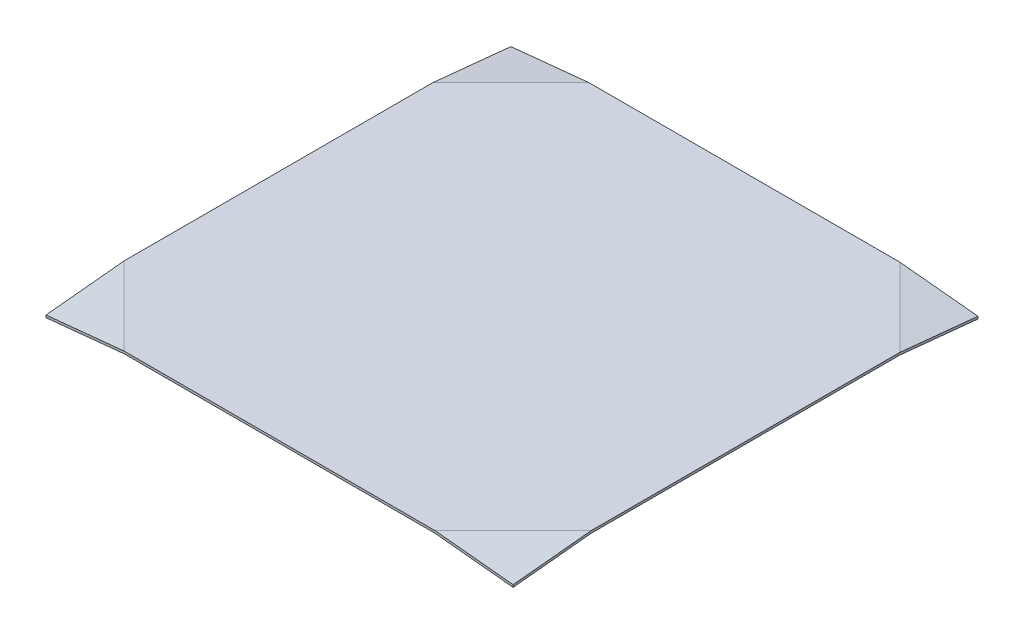
ISO-10303-21;
HEADER;
FILE_DESCRIPTION(('STEP AP214'),'2;1');
FILE_NAME('part.step','',(''),(''),'','','');
FILE_SCHEMA(('AUTOMOTIVE_DESIGN { 1 0 10303 214 1 1 1 1 }'));
ENDSEC;
DATA;
#1=APPLICATION_CONTEXT('core data for automotive mechanical design processes');
#2=APPLICATION_PROTOCOL_DEFINITION('international standard','automotive_design',2000,#1);
#3=PRODUCT_CONTEXT('',#1,'mechanical');
#4=PRODUCT('Part','Part','',(#3));
#5=PRODUCT_RELATED_PRODUCT_CATEGORY('part','',(#4));
#6=PRODUCT_DEFINITION_FORMATION('','',#4);
#7=PRODUCT_DEFINITION_CONTEXT('part definition',#1,'design');
#8=PRODUCT_DEFINITION('design','',#6,#7);
#9=PRODUCT_DEFINITION_SHAPE('','',#8);
#10=(LENGTH_UNIT() NAMED_UNIT(*) SI_UNIT(.MILLI.,.METRE.));
#11=(NAMED_UNIT(*) PLANE_ANGLE_UNIT() SI_UNIT($,.RADIAN.));
#12=(NAMED_UNIT(*) SI_UNIT($,.STERADIAN.) SOLID_ANGLE_UNIT());
#13=UNCERTAINTY_MEASURE_WITH_UNIT(LENGTH_MEASURE(1.E-05),#10,'distance_accuracy_value','');
#14=(GEOMETRIC_REPRESENTATION_CONTEXT(3) GLOBAL_UNCERTAINTY_ASSIGNED_CONTEXT((#13)) GLOBAL_UNIT_ASSIGNED_CONTEXT((#10,
#11,#12)) REPRESENTATION_CONTEXT('',''));
#15=CARTESIAN_POINT('',(0.,0.,0.));
#16=DIRECTION('',(0.,0.,1.));
#17=DIRECTION('',(1.,0.,0.));
#18=AXIS2_PLACEMENT_3D('',#15,#16,#17);
#19=CARTESIAN_POINT('',(-299.42,30.,298.));
#20=DIRECTION('',(0.,0.,-1.));
#21=DIRECTION('',(-1.,0.,0.));
#22=AXIS2_PLACEMENT_3D('',#19,#20,#21);
#23=PLANE('',#22);
#24=DIRECTION('',(-0.995037190209989,-0.0995037190209989,0.));
#25=VECTOR('',#24,1.);
#26=CARTESIAN_POINT('',(-298.1299156949,17.0991569490014,298.));
#27=LINE('',#26,#25);
#28=CARTESIAN_POINT('',(-199.121485184914,27.,298.));
#29=VERTEX_POINT('',#28);
#30=CARTESIAN_POINT('',(-299.42,16.9701485184914,298.));
#31=VERTEX_POINT('',#30);
#32=EDGE_CURVE('E272',#29,#31,#27,.T.);
#33=ORIENTED_EDGE('',*,*,#32,.F.);
#34=DIRECTION('',(1.,0.,0.));
#35=VECTOR('',#34,1.);
#36=CARTESIAN_POINT('',(-299.42,27.,298.));
#37=LINE('',#36,#35);
#38=CARTESIAN_POINT('',(199.121485184914,27.,298.));
#39=VERTEX_POINT('',#38);
#40=EDGE_CURVE('E277',#29,#39,#37,.T.);
#41=ORIENTED_EDGE('',*,*,#40,.T.);
#42=DIRECTION('',(0.995037190209989,-0.0995037190209989,0.));
#43=VECTOR('',#42,1.);
#44=CARTESIAN_POINT('',(-294.780975394209,76.3902460579123,298.));
#45=LINE('',#44,#43);
#46=CARTESIAN_POINT('',(299.42,16.9701485184914,298.));
#47=VERTEX_POINT('',#46);
#48=EDGE_CURVE('E287',#39,#47,#45,.T.);
#49=ORIENTED_EDGE('',*,*,#48,.T.);
#50=DIRECTION('',(0.,-1.,0.));
#51=VECTOR('',#50,1.);
#52=CARTESIAN_POINT('',(299.42,30.,298.));
#53=LINE('',#52,#51);
#54=CARTESIAN_POINT('',(299.42,20.,298.));
#55=VERTEX_POINT('',#54);
#56=EDGE_CURVE('E151',#55,#47,#53,.T.);
#57=ORIENTED_EDGE('',*,*,#56,.F.);
#58=DIRECTION('',(0.995037190209989,-0.0995037190209989,0.));
#59=VECTOR('',#58,1.);
#60=CARTESIAN_POINT('',(-294.48099009901,79.390099009901,298.));
#61=LINE('',#60,#59);
#62=CARTESIAN_POINT('',(199.42,30.,298.));
#63=VERTEX_POINT('',#62);
#64=EDGE_CURVE('E167',#63,#55,#61,.T.);
#65=ORIENTED_EDGE('',*,*,#64,.F.);
#66=DIRECTION('',(1.,0.,0.));
#67=VECTOR('',#66,1.);
#68=CARTESIAN_POINT('',(-299.42,30.,298.));
#69=LINE('',#68,#67);
#70=CARTESIAN_POINT('',(-199.42,30.,298.));
#71=VERTEX_POINT('',#70);
#72=EDGE_CURVE('E213',#71,#63,#69,.T.);
#73=ORIENTED_EDGE('',*,*,#72,.F.);
#74=DIRECTION('',(-0.995037190209989,-0.0995037190209989,0.));
#75=VECTOR('',#74,1.);
#76=CARTESIAN_POINT('',(-298.429900990099,20.0990099009901,298.));
#77=LINE('',#76,#75);
#78=CARTESIAN_POINT('',(-299.42,20.,298.));
#79=VERTEX_POINT('',#78);
#80=EDGE_CURVE('E194',#71,#79,#77,.T.);
#81=ORIENTED_EDGE('',*,*,#80,.T.);
#82=DIRECTION('',(0.,-1.,0.));
#83=VECTOR('',#82,1.);
#84=CARTESIAN_POINT('',(-299.42,30.,298.));
#85=LINE('',#84,#83);
#86=EDGE_CURVE('E157',#79,#31,#85,.T.);
#87=ORIENTED_EDGE('',*,*,#86,.T.);
#88=EDGE_LOOP('',(#33,#41,#49,#57,#65,#73,#81,#87));
#89=FACE_BOUND('',#88,.T.);
#90=ADVANCED_FACE('F41',(#89),#23,.F.);
#91=CARTESIAN_POINT('',(0.,30.,0.));
#92=DIRECTION('',(0.,1.,0.));
#93=DIRECTION('',(0.,0.,1.));
#94=AXIS2_PLACEMENT_3D('',#91,#92,#93);
#95=PLANE('',#94);
#96=DIRECTION('',(-1.,0.,0.));
#97=VECTOR('',#96,1.);
#98=CARTESIAN_POINT('',(-299.42,30.,-298.));
#99=LINE('',#98,#97);
#100=CARTESIAN_POINT('',(199.42,30.,-298.));
#101=VERTEX_POINT('',#100);
#102=CARTESIAN_POINT('',(-199.42,30.,-298.));
#103=VERTEX_POINT('',#102);
#104=EDGE_CURVE('E160',#101,#103,#99,.T.);
#105=ORIENTED_EDGE('',*,*,#104,.T.);
#106=DIRECTION('',(-0.707106781186548,0.,0.707106781186548));
#107=VECTOR('',#106,1.);
#108=CARTESIAN_POINT('',(-248.71,30.,-248.71));
#109=LINE('',#108,#107);
#110=CARTESIAN_POINT('',(-299.42,30.,-198.));
#111=VERTEX_POINT('',#110);
#112=EDGE_CURVE('E50',#103,#111,#109,.T.);
#113=ORIENTED_EDGE('',*,*,#112,.T.);
#114=DIRECTION('',(0.,0.,1.));
#115=VECTOR('',#114,1.);
#116=CARTESIAN_POINT('',(-299.42,30.,-298.));
#117=LINE('',#116,#115);
#118=CARTESIAN_POINT('',(-299.42,30.,198.));
#119=VERTEX_POINT('',#118);
#120=EDGE_CURVE('E207',#111,#119,#117,.T.);
#121=ORIENTED_EDGE('',*,*,#120,.T.);
#122=DIRECTION('',(-0.707106781186548,0.,-0.707106781186548));
#123=VECTOR('',#122,1.);
#124=CARTESIAN_POINT('',(-248.71,30.,248.71));
#125=LINE('',#124,#123);
#126=EDGE_CURVE('E186',#71,#119,#125,.T.);
#127=ORIENTED_EDGE('',*,*,#126,.F.);
#128=ORIENTED_EDGE('',*,*,#72,.T.);
#129=DIRECTION('',(0.707106781186548,0.,-0.707106781186548));
#130=VECTOR('',#129,1.);
#131=CARTESIAN_POINT('',(248.71,30.,248.71));
#132=LINE('',#131,#130);
#133=CARTESIAN_POINT('',(299.42,30.,198.));
#134=VERTEX_POINT('',#133);
#135=EDGE_CURVE('E173',#63,#134,#132,.T.);
#136=ORIENTED_EDGE('',*,*,#135,.T.);
#137=DIRECTION('',(0.,0.,-1.));
#138=VECTOR('',#137,1.);
#139=CARTESIAN_POINT('',(299.42,30.,-298.));
#140=LINE('',#139,#138);
#141=CARTESIAN_POINT('',(299.42,30.,-198.));
#142=VERTEX_POINT('',#141);
#143=EDGE_CURVE('E255',#134,#142,#140,.T.);
#144=ORIENTED_EDGE('',*,*,#143,.T.);
#145=DIRECTION('',(-0.707106781186548,0.,-0.707106781186548));
#146=VECTOR('',#145,1.);
#147=CARTESIAN_POINT('',(248.71,30.,-248.71));
#148=LINE('',#147,#146);
#149=EDGE_CURVE('E177',#142,#101,#148,.T.);
#150=ORIENTED_EDGE('',*,*,#149,.T.);
#151=EDGE_LOOP('',(#105,#113,#121,#127,#128,#136,#144,#150));
#152=FACE_BOUND('',#151,.T.);
#153=ADVANCED_FACE('F205',(#152),#95,.T.);
#154=CARTESIAN_POINT('',(-299.42,30.,-298.));
#155=DIRECTION('',(1.,0.,0.));
#156=DIRECTION('',(0.,0.,-1.));
#157=AXIS2_PLACEMENT_3D('',#154,#155,#156);
#158=PLANE('',#157);
#159=DIRECTION('',(0.,-1.,0.));
#160=VECTOR('',#159,1.);
#161=CARTESIAN_POINT('',(-299.42,30.,-298.));
#162=LINE('',#161,#160);
#163=CARTESIAN_POINT('',(-299.42,20.,-298.));
#164=VERTEX_POINT('',#163);
#165=CARTESIAN_POINT('',(-299.42,16.9701485184914,-298.));
#166=VERTEX_POINT('',#165);
#167=EDGE_CURVE('E152',#164,#166,#162,.T.);
#168=ORIENTED_EDGE('',*,*,#167,.T.);
#169=DIRECTION('',(0.,0.0995037190209989,0.995037190209989));
#170=VECTOR('',#169,1.);
#171=CARTESIAN_POINT('',(-299.42,17.0991569490014,-296.7099156949));
#172=LINE('',#171,#170);
#173=CARTESIAN_POINT('',(-299.42,27.,-197.701485184914));
#174=VERTEX_POINT('',#173);
#175=EDGE_CURVE('E268',#166,#174,#172,.T.);
#176=ORIENTED_EDGE('',*,*,#175,.T.);
#177=DIRECTION('',(0.,0.,1.));
#178=VECTOR('',#177,1.);
#179=CARTESIAN_POINT('',(-299.42,27.,-298.));
#180=LINE('',#179,#178);
#181=CARTESIAN_POINT('',(-299.42,27.,197.701485184914));
#182=VERTEX_POINT('',#181);
#183=EDGE_CURVE('E273',#174,#182,#180,.T.);
#184=ORIENTED_EDGE('',*,*,#183,.T.);
#185=DIRECTION('',(0.,0.0995037190209989,-0.995037190209989));
#186=VECTOR('',#185,1.);
#187=CARTESIAN_POINT('',(-299.42,76.1090579391004,-293.38909420609));
#188=LINE('',#187,#186);
#189=EDGE_CURVE('E278',#31,#182,#188,.T.);
#190=ORIENTED_EDGE('',*,*,#189,.F.);
#191=ORIENTED_EDGE('',*,*,#86,.F.);
#192=DIRECTION('',(0.,0.0995037190209989,-0.995037190209989));
#193=VECTOR('',#192,1.);
#194=CARTESIAN_POINT('',(-299.42,79.1089108910891,-293.089108910891));
#195=LINE('',#194,#193);
#196=EDGE_CURVE('E190',#79,#119,#195,.T.);
#197=ORIENTED_EDGE('',*,*,#196,.T.);
#198=ORIENTED_EDGE('',*,*,#120,.F.);
#199=DIRECTION('',(0.,0.0995037190209989,0.995037190209989));
#200=VECTOR('',#199,1.);
#201=CARTESIAN_POINT('',(-299.42,20.0990099009901,-297.009900990099));
#202=LINE('',#201,#200);
#203=EDGE_CURVE('E198',#164,#111,#202,.T.);
#204=ORIENTED_EDGE('',*,*,#203,.F.);
#205=EDGE_LOOP('',(#168,#176,#184,#190,#191,#197,#198,#204));
#206=FACE_BOUND('',#205,.T.);
#207=ADVANCED_FACE('F43',(#206),#158,.F.);
#208=CARTESIAN_POINT('',(299.42,30.,-298.));
#209=DIRECTION('',(-1.,0.,0.));
#210=DIRECTION('',(0.,0.,1.));
#211=AXIS2_PLACEMENT_3D('',#208,#209,#210);
#212=PLANE('',#211);
#213=DIRECTION('',(0.,0.,-1.));
#214=VECTOR('',#213,1.);
#215=CARTESIAN_POINT('',(299.42,27.,-298.));
#216=LINE('',#215,#214);
#217=CARTESIAN_POINT('',(299.42,27.,197.701485184914));
#218=VERTEX_POINT('',#217);
#219=CARTESIAN_POINT('',(299.42,27.,-197.701485184914));
#220=VERTEX_POINT('',#219);
#221=EDGE_CURVE('E144',#218,#220,#216,.T.);
#222=ORIENTED_EDGE('',*,*,#221,.T.);
#223=DIRECTION('',(0.,-0.0995037190209989,-0.995037190209989));
#224=VECTOR('',#223,1.);
#225=CARTESIAN_POINT('',(299.42,17.0991569490014,-296.7099156949));
#226=LINE('',#225,#224);
#227=CARTESIAN_POINT('',(299.42,16.9701485184914,-298.));
#228=VERTEX_POINT('',#227);
#229=EDGE_CURVE('E130',#220,#228,#226,.T.);
#230=ORIENTED_EDGE('',*,*,#229,.T.);
#231=DIRECTION('',(0.,-1.,0.));
#232=VECTOR('',#231,1.);
#233=CARTESIAN_POINT('',(299.42,30.,-298.));
#234=LINE('',#233,#232);
#235=CARTESIAN_POINT('',(299.42,20.,-298.));
#236=VERTEX_POINT('',#235);
#237=EDGE_CURVE('E140',#236,#228,#234,.T.);
#238=ORIENTED_EDGE('',*,*,#237,.F.);
#239=DIRECTION('',(0.,-0.0995037190209989,-0.995037190209989));
#240=VECTOR('',#239,1.);
#241=CARTESIAN_POINT('',(299.42,20.0990099009901,-297.009900990099));
#242=LINE('',#241,#240);
#243=EDGE_CURVE('E181',#142,#236,#242,.T.);
#244=ORIENTED_EDGE('',*,*,#243,.F.);
#245=ORIENTED_EDGE('',*,*,#143,.F.);
#246=DIRECTION('',(0.,0.0995037190209989,-0.995037190209989));
#247=VECTOR('',#246,1.);
#248=CARTESIAN_POINT('',(299.42,79.1089108910891,-293.089108910891));
#249=LINE('',#248,#247);
#250=EDGE_CURVE('E170',#55,#134,#249,.T.);
#251=ORIENTED_EDGE('',*,*,#250,.F.);
#252=ORIENTED_EDGE('',*,*,#56,.T.);
#253=DIRECTION('',(0.,0.0995037190209989,-0.995037190209989));
#254=VECTOR('',#253,1.);
#255=CARTESIAN_POINT('',(299.42,76.1090579391004,-293.38909420609));
#256=LINE('',#255,#254);
#257=EDGE_CURVE('E291',#47,#218,#256,.T.);
#258=ORIENTED_EDGE('',*,*,#257,.T.);
#259=EDGE_LOOP('',(#222,#230,#238,#244,#245,#251,#252,#258));
#260=FACE_BOUND('',#259,.T.);
#261=ADVANCED_FACE('F139',(#260),#212,.F.);
#262=CARTESIAN_POINT('',(-299.42,30.,-298.));
#263=DIRECTION('',(0.,0.,1.));
#264=DIRECTION('',(1.,0.,0.));
#265=AXIS2_PLACEMENT_3D('',#262,#263,#264);
#266=PLANE('',#265);
#267=DIRECTION('',(-1.,0.,0.));
#268=VECTOR('',#267,1.);
#269=CARTESIAN_POINT('',(-299.42,27.,-298.));
#270=LINE('',#269,#268);
#271=CARTESIAN_POINT('',(199.121485184914,27.,-298.));
#272=VERTEX_POINT('',#271);
#273=CARTESIAN_POINT('',(-199.121485184914,27.,-298.));
#274=VERTEX_POINT('',#273);
#275=EDGE_CURVE('E292',#272,#274,#270,.T.);
#276=ORIENTED_EDGE('',*,*,#275,.T.);
#277=DIRECTION('',(-0.995037190209989,-0.0995037190209989,0.));
#278=VECTOR('',#277,1.);
#279=CARTESIAN_POINT('',(-298.1299156949,17.0991569490014,-298.));
#280=LINE('',#279,#278);
#281=EDGE_CURVE('E214',#274,#166,#280,.T.);
#282=ORIENTED_EDGE('',*,*,#281,.T.);
#283=ORIENTED_EDGE('',*,*,#167,.F.);
#284=DIRECTION('',(-0.995037190209989,-0.0995037190209989,0.));
#285=VECTOR('',#284,1.);
#286=CARTESIAN_POINT('',(-298.429900990099,20.0990099009901,-298.));
#287=LINE('',#286,#285);
#288=EDGE_CURVE('E11',#103,#164,#287,.T.);
#289=ORIENTED_EDGE('',*,*,#288,.F.);
#290=ORIENTED_EDGE('',*,*,#104,.F.);
#291=DIRECTION('',(-0.995037190209989,0.0995037190209989,0.));
#292=VECTOR('',#291,1.);
#293=CARTESIAN_POINT('',(-294.48099009901,79.390099009901,-298.));
#294=LINE('',#293,#292);
#295=EDGE_CURVE('E149',#236,#101,#294,.T.);
#296=ORIENTED_EDGE('',*,*,#295,.F.);
#297=ORIENTED_EDGE('',*,*,#237,.T.);
#298=DIRECTION('',(-0.995037190209989,0.0995037190209989,0.));
#299=VECTOR('',#298,1.);
#300=CARTESIAN_POINT('',(-294.780975394209,76.3902460579123,-298.));
#301=LINE('',#300,#299);
#302=EDGE_CURVE('E127',#228,#272,#301,.T.);
#303=ORIENTED_EDGE('',*,*,#302,.T.);
#304=EDGE_LOOP('',(#276,#282,#283,#289,#290,#296,#297,#303));
#305=FACE_BOUND('',#304,.T.);
#306=ADVANCED_FACE('F147',(#305),#266,.F.);
#307=CARTESIAN_POINT('',(7.8178431372549,78.178431372549,7.8178431372549));
#308=DIRECTION('',(0.0990147542976674,0.990147542976674,0.0990147542976674));
#309=DIRECTION('',(0.,-0.0995037190209989,0.995037190209989));
#310=AXIS2_PLACEMENT_3D('',#307,#308,#309);
#311=PLANE('',#310);
#312=ORIENTED_EDGE('',*,*,#135,.F.);
#313=ORIENTED_EDGE('',*,*,#64,.T.);
#314=ORIENTED_EDGE('',*,*,#250,.T.);
#315=EDGE_LOOP('',(#312,#313,#314));
#316=FACE_BOUND('',#315,.T.);
#317=ADVANCED_FACE('F243',(#316),#311,.T.);
#318=CARTESIAN_POINT('',(7.8178431372549,78.178431372549,-7.8178431372549));
#319=DIRECTION('',(0.0990147542976674,0.990147542976674,-0.0990147542976674));
#320=DIRECTION('',(0.,0.0995037190209989,0.995037190209989));
#321=AXIS2_PLACEMENT_3D('',#318,#319,#320);
#322=PLANE('',#321);
#323=ORIENTED_EDGE('',*,*,#149,.F.);
#324=ORIENTED_EDGE('',*,*,#243,.T.);
#325=ORIENTED_EDGE('',*,*,#295,.T.);
#326=EDGE_LOOP('',(#323,#324,#325));
#327=FACE_BOUND('',#326,.T.);
#328=ADVANCED_FACE('F228',(#327),#322,.T.);
#329=CARTESIAN_POINT('',(-7.8178431372549,78.178431372549,7.8178431372549));
#330=DIRECTION('',(0.0990147542976674,-0.990147542976674,-0.0990147542976674));
#331=DIRECTION('',(0.,0.0995037190209989,-0.995037190209989));
#332=AXIS2_PLACEMENT_3D('',#329,#330,#331);
#333=PLANE('',#332);
#334=ORIENTED_EDGE('',*,*,#80,.F.);
#335=ORIENTED_EDGE('',*,*,#126,.T.);
#336=ORIENTED_EDGE('',*,*,#196,.F.);
#337=EDGE_LOOP('',(#334,#335,#336));
#338=FACE_BOUND('',#337,.T.);
#339=ADVANCED_FACE('F219',(#338),#333,.F.);
#340=CARTESIAN_POINT('',(-7.8178431372549,78.178431372549,-7.8178431372549));
#341=DIRECTION('',(-0.0990147542976674,0.990147542976674,-0.0990147542976674));
#342=DIRECTION('',(0.,0.0995037190209989,0.995037190209989));
#343=AXIS2_PLACEMENT_3D('',#340,#341,#342);
#344=PLANE('',#343);
#345=ORIENTED_EDGE('',*,*,#288,.T.);
#346=ORIENTED_EDGE('',*,*,#203,.T.);
#347=ORIENTED_EDGE('',*,*,#112,.F.);
#348=EDGE_LOOP('',(#345,#346,#347));
#349=FACE_BOUND('',#348,.T.);
#350=ADVANCED_FACE('F216',(#349),#344,.T.);
#351=CARTESIAN_POINT('',(0.,27.,0.));
#352=DIRECTION('',(0.,1.,0.));
#353=DIRECTION('',(0.,0.,1.));
#354=AXIS2_PLACEMENT_3D('',#351,#352,#353);
#355=PLANE('',#354);
#356=ORIENTED_EDGE('',*,*,#275,.F.);
#357=DIRECTION('',(-0.707106781186548,0.,-0.707106781186548));
#358=VECTOR('',#357,1.);
#359=CARTESIAN_POINT('',(248.560742592457,27.,-248.560742592457));
#360=LINE('',#359,#358);
#361=EDGE_CURVE('E57',#220,#272,#360,.T.);
#362=ORIENTED_EDGE('',*,*,#361,.F.);
#363=ORIENTED_EDGE('',*,*,#221,.F.);
#364=DIRECTION('',(0.707106781186548,0.,-0.707106781186548));
#365=VECTOR('',#364,1.);
#366=CARTESIAN_POINT('',(248.560742592457,27.,248.560742592457));
#367=LINE('',#366,#365);
#368=EDGE_CURVE('E295',#39,#218,#367,.T.);
#369=ORIENTED_EDGE('',*,*,#368,.F.);
#370=ORIENTED_EDGE('',*,*,#40,.F.);
#371=DIRECTION('',(-0.707106781186548,0.,-0.707106781186548));
#372=VECTOR('',#371,1.);
#373=CARTESIAN_POINT('',(-248.560742592457,27.,248.560742592457));
#374=LINE('',#373,#372);
#375=EDGE_CURVE('E134',#29,#182,#374,.T.);
#376=ORIENTED_EDGE('',*,*,#375,.T.);
#377=ORIENTED_EDGE('',*,*,#183,.F.);
#378=DIRECTION('',(-0.707106781186548,0.,0.707106781186548));
#379=VECTOR('',#378,1.);
#380=CARTESIAN_POINT('',(-248.560742592457,27.,-248.560742592457));
#381=LINE('',#380,#379);
#382=EDGE_CURVE('E267',#274,#174,#381,.T.);
#383=ORIENTED_EDGE('',*,*,#382,.F.);
#384=EDGE_LOOP('',(#356,#362,#363,#369,#370,#376,#377,#383));
#385=FACE_BOUND('',#384,.T.);
#386=ADVANCED_FACE('F218',(#385),#355,.F.);
#387=CARTESIAN_POINT('',(7.5207988743619,75.207988743619,7.5207988743619));
#388=DIRECTION('',(0.0990147542976674,0.990147542976674,0.0990147542976674));
#389=DIRECTION('',(0.,-0.0995037190209989,0.995037190209989));
#390=AXIS2_PLACEMENT_3D('',#387,#388,#389);
#391=PLANE('',#390);
#392=ORIENTED_EDGE('',*,*,#368,.T.);
#393=ORIENTED_EDGE('',*,*,#257,.F.);
#394=ORIENTED_EDGE('',*,*,#48,.F.);
#395=EDGE_LOOP('',(#392,#393,#394));
#396=FACE_BOUND('',#395,.T.);
#397=ADVANCED_FACE('F225',(#396),#391,.F.);
#398=CARTESIAN_POINT('',(7.5207988743619,75.207988743619,-7.5207988743619));
#399=DIRECTION('',(0.0990147542976674,0.990147542976674,-0.0990147542976674));
#400=DIRECTION('',(0.,0.0995037190209989,0.995037190209989));
#401=AXIS2_PLACEMENT_3D('',#398,#399,#400);
#402=PLANE('',#401);
#403=ORIENTED_EDGE('',*,*,#361,.T.);
#404=ORIENTED_EDGE('',*,*,#302,.F.);
#405=ORIENTED_EDGE('',*,*,#229,.F.);
#406=EDGE_LOOP('',(#403,#404,#405));
#407=FACE_BOUND('',#406,.T.);
#408=ADVANCED_FACE('F129',(#407),#402,.F.);
#409=CARTESIAN_POINT('',(-7.5207988743619,75.207988743619,7.5207988743619));
#410=DIRECTION('',(0.0990147542976674,-0.990147542976674,-0.0990147542976674));
#411=DIRECTION('',(0.,0.0995037190209989,-0.995037190209989));
#412=AXIS2_PLACEMENT_3D('',#409,#410,#411);
#413=PLANE('',#412);
#414=ORIENTED_EDGE('',*,*,#32,.T.);
#415=ORIENTED_EDGE('',*,*,#189,.T.);
#416=ORIENTED_EDGE('',*,*,#375,.F.);
#417=EDGE_LOOP('',(#414,#415,#416));
#418=FACE_BOUND('',#417,.T.);
#419=ADVANCED_FACE('F318',(#418),#413,.T.);
#420=CARTESIAN_POINT('',(-7.5207988743619,75.207988743619,-7.5207988743619));
#421=DIRECTION('',(-0.0990147542976674,0.990147542976674,-0.0990147542976674));
#422=DIRECTION('',(0.,0.0995037190209989,0.995037190209989));
#423=AXIS2_PLACEMENT_3D('',#420,#421,#422);
#424=PLANE('',#423);
#425=ORIENTED_EDGE('',*,*,#281,.F.);
#426=ORIENTED_EDGE('',*,*,#382,.T.);
#427=ORIENTED_EDGE('',*,*,#175,.F.);
#428=EDGE_LOOP('',(#425,#426,#427));
#429=FACE_BOUND('',#428,.T.);
#430=ADVANCED_FACE('F310',(#429),#424,.F.);
#431=CLOSED_SHELL('',(#90,#153,#207,#261,#306,#317,#328,#339,#350,#386,#397,#408,#419,#430));
#432=MANIFOLD_SOLID_BREP('B2',#431);
#433=ADVANCED_BREP_SHAPE_REPRESENTATION('',(#18,#432),#14);
#434=SHAPE_DEFINITION_REPRESENTATION(#9,#433);
ENDSEC;
END-ISO-10303-21;
